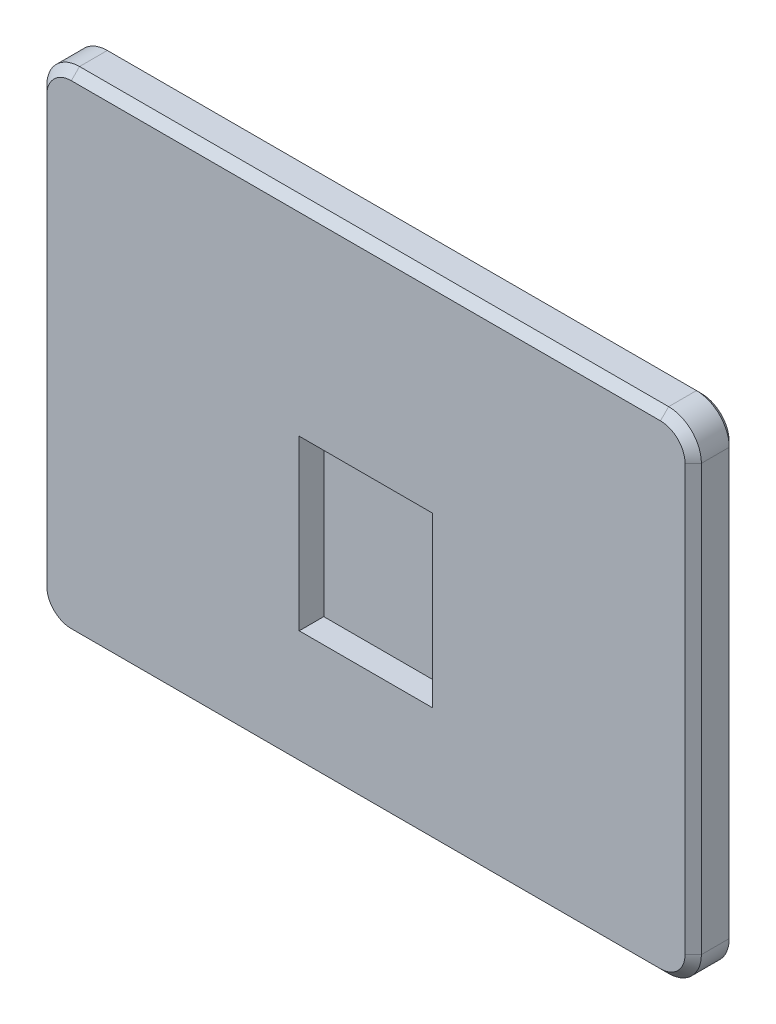
ISO-10303-21;
HEADER;
FILE_DESCRIPTION(('STEP AP214'),'2;1');
FILE_NAME('part.step','',(''),(''),'','','');
FILE_SCHEMA(('AUTOMOTIVE_DESIGN { 1 0 10303 214 1 1 1 1 }'));
ENDSEC;
DATA;
#1=APPLICATION_CONTEXT('core data for automotive mechanical design processes');
#2=APPLICATION_PROTOCOL_DEFINITION('international standard','automotive_design',2000,#1);
#3=PRODUCT_CONTEXT('',#1,'mechanical');
#4=PRODUCT('Part','Part','',(#3));
#5=PRODUCT_RELATED_PRODUCT_CATEGORY('part','',(#4));
#6=PRODUCT_DEFINITION_FORMATION('','',#4);
#7=PRODUCT_DEFINITION_CONTEXT('part definition',#1,'design');
#8=PRODUCT_DEFINITION('design','',#6,#7);
#9=PRODUCT_DEFINITION_SHAPE('','',#8);
#10=(LENGTH_UNIT() NAMED_UNIT(*) SI_UNIT(.MILLI.,.METRE.));
#11=(NAMED_UNIT(*) PLANE_ANGLE_UNIT() SI_UNIT($,.RADIAN.));
#12=(NAMED_UNIT(*) SI_UNIT($,.STERADIAN.) SOLID_ANGLE_UNIT());
#13=UNCERTAINTY_MEASURE_WITH_UNIT(LENGTH_MEASURE(1.E-05),#10,'distance_accuracy_value','');
#14=(GEOMETRIC_REPRESENTATION_CONTEXT(3) GLOBAL_UNCERTAINTY_ASSIGNED_CONTEXT((#13)) GLOBAL_UNIT_ASSIGNED_CONTEXT((#10,
#11,#12)) REPRESENTATION_CONTEXT('',''));
#15=CARTESIAN_POINT('',(0.,0.,0.));
#16=DIRECTION('',(0.,0.,1.));
#17=DIRECTION('',(1.,0.,0.));
#18=AXIS2_PLACEMENT_3D('',#15,#16,#17);
#19=CARTESIAN_POINT('',(20.,-15.,2.5));
#20=DIRECTION('',(-1.,0.,0.));
#21=DIRECTION('',(0.,0.,1.));
#22=AXIS2_PLACEMENT_3D('',#19,#20,#21);
#23=PLANE('',#22);
#24=DIRECTION('',(0.,0.,-1.));
#25=VECTOR('',#24,1.);
#26=CARTESIAN_POINT('',(20.,-13.,2.5));
#27=LINE('',#26,#25);
#28=CARTESIAN_POINT('',(20.,-13.,2.00000000000001));
#29=VERTEX_POINT('',#28);
#30=CARTESIAN_POINT('',(20.,-13.,0.299999999999995));
#31=VERTEX_POINT('',#30);
#32=EDGE_CURVE('E252',#29,#31,#27,.T.);
#33=ORIENTED_EDGE('',*,*,#32,.T.);
#34=DIRECTION('',(0.,1.,0.));
#35=VECTOR('',#34,1.);
#36=CARTESIAN_POINT('',(20.,13.,0.299999999999995));
#37=LINE('',#36,#35);
#38=CARTESIAN_POINT('',(20.,13.,0.299999999999995));
#39=VERTEX_POINT('',#38);
#40=EDGE_CURVE('E375',#31,#39,#37,.T.);
#41=ORIENTED_EDGE('',*,*,#40,.T.);
#42=DIRECTION('',(0.,0.,-1.));
#43=VECTOR('',#42,1.);
#44=CARTESIAN_POINT('',(20.,13.,2.5));
#45=LINE('',#44,#43);
#46=CARTESIAN_POINT('',(20.,13.,2.00000000000001));
#47=VERTEX_POINT('',#46);
#48=EDGE_CURVE('E249',#39,#47,#45,.F.);
#49=ORIENTED_EDGE('',*,*,#48,.T.);
#50=DIRECTION('',(0.,-1.,0.));
#51=VECTOR('',#50,1.);
#52=CARTESIAN_POINT('',(20.,-15.,2.00000000000001));
#53=LINE('',#52,#51);
#54=EDGE_CURVE('E300',#47,#29,#53,.T.);
#55=ORIENTED_EDGE('',*,*,#54,.T.);
#56=EDGE_LOOP('',(#33,#41,#49,#55));
#57=FACE_BOUND('',#56,.T.);
#58=ADVANCED_FACE('F41',(#57),#23,.F.);
#59=CARTESIAN_POINT('',(-20.,15.,2.5));
#60=DIRECTION('',(0.,-1.,0.));
#61=DIRECTION('',(0.,0.,-1.));
#62=AXIS2_PLACEMENT_3D('',#59,#60,#61);
#63=PLANE('',#62);
#64=DIRECTION('',(0.,0.,-1.));
#65=VECTOR('',#64,1.);
#66=CARTESIAN_POINT('',(18.,15.,2.5));
#67=LINE('',#66,#65);
#68=CARTESIAN_POINT('',(18.,15.,2.00000000000001));
#69=VERTEX_POINT('',#68);
#70=CARTESIAN_POINT('',(18.,15.,0.299999999999995));
#71=VERTEX_POINT('',#70);
#72=EDGE_CURVE('E256',#69,#71,#67,.T.);
#73=ORIENTED_EDGE('',*,*,#72,.T.);
#74=DIRECTION('',(-1.,0.,0.));
#75=VECTOR('',#74,1.);
#76=CARTESIAN_POINT('',(-18.,15.,0.299999999999995));
#77=LINE('',#76,#75);
#78=CARTESIAN_POINT('',(-18.,15.,0.299999999999995));
#79=VERTEX_POINT('',#78);
#80=EDGE_CURVE('E381',#71,#79,#77,.T.);
#81=ORIENTED_EDGE('',*,*,#80,.T.);
#82=DIRECTION('',(0.,0.,-1.));
#83=VECTOR('',#82,1.);
#84=CARTESIAN_POINT('',(-18.,15.,2.5));
#85=LINE('',#84,#83);
#86=CARTESIAN_POINT('',(-18.,15.,2.00000000000001));
#87=VERTEX_POINT('',#86);
#88=EDGE_CURVE('E260',#79,#87,#85,.F.);
#89=ORIENTED_EDGE('',*,*,#88,.T.);
#90=DIRECTION('',(1.,0.,0.));
#91=VECTOR('',#90,1.);
#92=CARTESIAN_POINT('',(-20.,15.,2.00000000000001));
#93=LINE('',#92,#91);
#94=EDGE_CURVE('E314',#87,#69,#93,.T.);
#95=ORIENTED_EDGE('',*,*,#94,.T.);
#96=EDGE_LOOP('',(#73,#81,#89,#95));
#97=FACE_BOUND('',#96,.T.);
#98=ADVANCED_FACE('F462',(#97),#63,.F.);
#99=CARTESIAN_POINT('',(-20.,-15.,2.5));
#100=DIRECTION('',(1.,0.,0.));
#101=DIRECTION('',(0.,0.,-1.));
#102=AXIS2_PLACEMENT_3D('',#99,#100,#101);
#103=PLANE('',#102);
#104=DIRECTION('',(0.,0.,-1.));
#105=VECTOR('',#104,1.);
#106=CARTESIAN_POINT('',(-20.,13.,2.5));
#107=LINE('',#106,#105);
#108=CARTESIAN_POINT('',(-20.,13.,2.00000000000001));
#109=VERTEX_POINT('',#108);
#110=CARTESIAN_POINT('',(-20.,13.,0.299999999999995));
#111=VERTEX_POINT('',#110);
#112=EDGE_CURVE('E243',#109,#111,#107,.T.);
#113=ORIENTED_EDGE('',*,*,#112,.T.);
#114=DIRECTION('',(0.,-1.,0.));
#115=VECTOR('',#114,1.);
#116=CARTESIAN_POINT('',(-20.,-13.,0.299999999999995));
#117=LINE('',#116,#115);
#118=CARTESIAN_POINT('',(-20.,-13.,0.299999999999995));
#119=VERTEX_POINT('',#118);
#120=EDGE_CURVE('E67',#111,#119,#117,.T.);
#121=ORIENTED_EDGE('',*,*,#120,.T.);
#122=DIRECTION('',(0.,0.,-1.));
#123=VECTOR('',#122,1.);
#124=CARTESIAN_POINT('',(-20.,-13.,2.5));
#125=LINE('',#124,#123);
#126=CARTESIAN_POINT('',(-20.,-13.,2.00000000000001));
#127=VERTEX_POINT('',#126);
#128=EDGE_CURVE('E246',#119,#127,#125,.F.);
#129=ORIENTED_EDGE('',*,*,#128,.T.);
#130=DIRECTION('',(0.,1.,0.));
#131=VECTOR('',#130,1.);
#132=CARTESIAN_POINT('',(-20.,-15.,2.00000000000001));
#133=LINE('',#132,#131);
#134=EDGE_CURVE('E303',#127,#109,#133,.T.);
#135=ORIENTED_EDGE('',*,*,#134,.T.);
#136=EDGE_LOOP('',(#113,#121,#129,#135));
#137=FACE_BOUND('',#136,.T.);
#138=ADVANCED_FACE('F434',(#137),#103,.F.);
#139=CARTESIAN_POINT('',(-20.,-15.,2.5));
#140=DIRECTION('',(0.,1.,0.));
#141=DIRECTION('',(0.,0.,1.));
#142=AXIS2_PLACEMENT_3D('',#139,#140,#141);
#143=PLANE('',#142);
#144=DIRECTION('',(0.,0.,-1.));
#145=VECTOR('',#144,1.);
#146=CARTESIAN_POINT('',(-18.,-15.,2.5));
#147=LINE('',#146,#145);
#148=CARTESIAN_POINT('',(-18.,-15.,2.00000000000001));
#149=VERTEX_POINT('',#148);
#150=CARTESIAN_POINT('',(-18.,-15.,0.299999999999995));
#151=VERTEX_POINT('',#150);
#152=EDGE_CURVE('E240',#149,#151,#147,.T.);
#153=ORIENTED_EDGE('',*,*,#152,.T.);
#154=DIRECTION('',(1.,0.,0.));
#155=VECTOR('',#154,1.);
#156=CARTESIAN_POINT('',(18.,-15.,0.299999999999995));
#157=LINE('',#156,#155);
#158=CARTESIAN_POINT('',(18.,-15.,0.299999999999995));
#159=VERTEX_POINT('',#158);
#160=EDGE_CURVE('E11',#151,#159,#157,.T.);
#161=ORIENTED_EDGE('',*,*,#160,.T.);
#162=DIRECTION('',(0.,0.,-1.));
#163=VECTOR('',#162,1.);
#164=CARTESIAN_POINT('',(18.,-15.,2.5));
#165=LINE('',#164,#163);
#166=CARTESIAN_POINT('',(18.,-15.,2.00000000000001));
#167=VERTEX_POINT('',#166);
#168=EDGE_CURVE('E232',#159,#167,#165,.F.);
#169=ORIENTED_EDGE('',*,*,#168,.T.);
#170=DIRECTION('',(-1.,0.,0.));
#171=VECTOR('',#170,1.);
#172=CARTESIAN_POINT('',(-20.,-15.,2.00000000000001));
#173=LINE('',#172,#171);
#174=EDGE_CURVE('E288',#167,#149,#173,.T.);
#175=ORIENTED_EDGE('',*,*,#174,.T.);
#176=EDGE_LOOP('',(#153,#161,#169,#175));
#177=FACE_BOUND('',#176,.T.);
#178=ADVANCED_FACE('F493',(#177),#143,.F.);
#179=CARTESIAN_POINT('',(0.,0.,2.5));
#180=DIRECTION('',(0.,0.,-1.));
#181=DIRECTION('',(-1.,0.,0.));
#182=AXIS2_PLACEMENT_3D('',#179,#180,#181);
#183=PLANE('',#182);
#184=CARTESIAN_POINT('',(-18.,-13.,2.5));
#185=DIRECTION('',(0.,0.,-1.));
#186=DIRECTION('',(-1.,0.,0.));
#187=AXIS2_PLACEMENT_3D('',#184,#185,#186);
#188=CIRCLE('',#187,1.50000000000001);
#189=CARTESIAN_POINT('',(-19.5,-13.,2.5));
#190=VERTEX_POINT('',#189);
#191=CARTESIAN_POINT('',(-18.,-14.5,2.5));
#192=VERTEX_POINT('',#191);
#193=EDGE_CURVE('E278',#190,#192,#188,.F.);
#194=ORIENTED_EDGE('',*,*,#193,.T.);
#195=DIRECTION('',(1.,0.,0.));
#196=VECTOR('',#195,1.);
#197=CARTESIAN_POINT('',(0.,-14.5,2.5));
#198=LINE('',#197,#196);
#199=CARTESIAN_POINT('',(18.,-14.5,2.5));
#200=VERTEX_POINT('',#199);
#201=EDGE_CURVE('E284',#192,#200,#198,.T.);
#202=ORIENTED_EDGE('',*,*,#201,.T.);
#203=CARTESIAN_POINT('',(18.,-13.,2.5));
#204=DIRECTION('',(0.,0.,-1.));
#205=DIRECTION('',(-1.,0.,0.));
#206=AXIS2_PLACEMENT_3D('',#203,#204,#205);
#207=CIRCLE('',#206,1.50000000000001);
#208=CARTESIAN_POINT('',(19.5,-13.,2.5));
#209=VERTEX_POINT('',#208);
#210=EDGE_CURVE('E281',#200,#209,#207,.F.);
#211=ORIENTED_EDGE('',*,*,#210,.T.);
#212=DIRECTION('',(0.,1.,0.));
#213=VECTOR('',#212,1.);
#214=CARTESIAN_POINT('',(19.5,0.,2.5));
#215=LINE('',#214,#213);
#216=CARTESIAN_POINT('',(19.5,13.,2.5));
#217=VERTEX_POINT('',#216);
#218=EDGE_CURVE('E275',#209,#217,#215,.T.);
#219=ORIENTED_EDGE('',*,*,#218,.T.);
#220=CARTESIAN_POINT('',(18.,13.,2.5));
#221=DIRECTION('',(0.,0.,-1.));
#222=DIRECTION('',(-1.,0.,0.));
#223=AXIS2_PLACEMENT_3D('',#220,#221,#222);
#224=CIRCLE('',#223,1.50000000000001);
#225=CARTESIAN_POINT('',(18.,14.5,2.5));
#226=VERTEX_POINT('',#225);
#227=EDGE_CURVE('E269',#217,#226,#224,.F.);
#228=ORIENTED_EDGE('',*,*,#227,.T.);
#229=DIRECTION('',(-1.,0.,0.));
#230=VECTOR('',#229,1.);
#231=CARTESIAN_POINT('',(0.,14.5,2.5));
#232=LINE('',#231,#230);
#233=CARTESIAN_POINT('',(-18.,14.5,2.5));
#234=VERTEX_POINT('',#233);
#235=EDGE_CURVE('E263',#226,#234,#232,.T.);
#236=ORIENTED_EDGE('',*,*,#235,.T.);
#237=CARTESIAN_POINT('',(-18.,13.,2.5));
#238=DIRECTION('',(0.,0.,-1.));
#239=DIRECTION('',(-1.,0.,0.));
#240=AXIS2_PLACEMENT_3D('',#237,#238,#239);
#241=CIRCLE('',#240,1.50000000000001);
#242=CARTESIAN_POINT('',(-19.5,13.,2.5));
#243=VERTEX_POINT('',#242);
#244=EDGE_CURVE('E266',#234,#243,#241,.F.);
#245=ORIENTED_EDGE('',*,*,#244,.T.);
#246=DIRECTION('',(0.,-1.,0.));
#247=VECTOR('',#246,1.);
#248=CARTESIAN_POINT('',(-19.5,0.,2.5));
#249=LINE('',#248,#247);
#250=EDGE_CURVE('E272',#243,#190,#249,.T.);
#251=ORIENTED_EDGE('',*,*,#250,.T.);
#252=EDGE_LOOP('',(#194,#202,#211,#219,#228,#236,#245,#251));
#253=FACE_BOUND('',#252,.T.);
#254=DIRECTION('',(-1.,0.,0.));
#255=VECTOR('',#254,1.);
#256=CARTESIAN_POINT('',(-4.075,2.65,2.5));
#257=LINE('',#256,#255);
#258=CARTESIAN_POINT('',(4.075,2.65,2.5));
#259=VERTEX_POINT('',#258);
#260=CARTESIAN_POINT('',(-4.075,2.65,2.5));
#261=VERTEX_POINT('',#260);
#262=EDGE_CURVE('E222',#259,#261,#257,.T.);
#263=ORIENTED_EDGE('',*,*,#262,.F.);
#264=DIRECTION('',(0.,1.,0.));
#265=VECTOR('',#264,1.);
#266=CARTESIAN_POINT('',(4.075,-7.65,2.5));
#267=LINE('',#266,#265);
#268=CARTESIAN_POINT('',(4.075,-7.65,2.5));
#269=VERTEX_POINT('',#268);
#270=EDGE_CURVE('E189',#269,#259,#267,.T.);
#271=ORIENTED_EDGE('',*,*,#270,.F.);
#272=DIRECTION('',(1.,0.,0.));
#273=VECTOR('',#272,1.);
#274=CARTESIAN_POINT('',(-4.075,-7.65,2.5));
#275=LINE('',#274,#273);
#276=CARTESIAN_POINT('',(-4.075,-7.65,2.5));
#277=VERTEX_POINT('',#276);
#278=EDGE_CURVE('E209',#277,#269,#275,.T.);
#279=ORIENTED_EDGE('',*,*,#278,.F.);
#280=DIRECTION('',(0.,-1.,0.));
#281=VECTOR('',#280,1.);
#282=CARTESIAN_POINT('',(-4.075,-7.65,2.5));
#283=LINE('',#282,#281);
#284=EDGE_CURVE('E213',#261,#277,#283,.T.);
#285=ORIENTED_EDGE('',*,*,#284,.F.);
#286=EDGE_LOOP('',(#263,#271,#279,#285));
#287=FACE_BOUND('',#286,.T.);
#288=ADVANCED_FACE('F448',(#253,#287),#183,.F.);
#289=CARTESIAN_POINT('',(0.,0.,0.));
#290=DIRECTION('',(0.,0.,-1.));
#291=DIRECTION('',(-1.,0.,0.));
#292=AXIS2_PLACEMENT_3D('',#289,#290,#291);
#293=PLANE('',#292);
#294=DIRECTION('',(0.,-1.,0.));
#295=VECTOR('',#294,1.);
#296=CARTESIAN_POINT('',(19.7,-13.,0.));
#297=LINE('',#296,#295);
#298=CARTESIAN_POINT('',(19.7,13.,0.));
#299=VERTEX_POINT('',#298);
#300=CARTESIAN_POINT('',(19.7,-13.,0.));
#301=VERTEX_POINT('',#300);
#302=EDGE_CURVE('E364',#299,#301,#297,.T.);
#303=ORIENTED_EDGE('',*,*,#302,.T.);
#304=CARTESIAN_POINT('',(18.,-13.,0.));
#305=DIRECTION('',(0.,0.,-1.));
#306=DIRECTION('',(-1.,0.,0.));
#307=AXIS2_PLACEMENT_3D('',#304,#305,#306);
#308=CIRCLE('',#307,1.70000000000001);
#309=CARTESIAN_POINT('',(18.,-14.7,0.));
#310=VERTEX_POINT('',#309);
#311=EDGE_CURVE('E367',#301,#310,#308,.T.);
#312=ORIENTED_EDGE('',*,*,#311,.T.);
#313=DIRECTION('',(-1.,0.,0.));
#314=VECTOR('',#313,1.);
#315=CARTESIAN_POINT('',(-18.,-14.7,0.));
#316=LINE('',#315,#314);
#317=CARTESIAN_POINT('',(-18.,-14.7,0.));
#318=VERTEX_POINT('',#317);
#319=EDGE_CURVE('E317',#310,#318,#316,.T.);
#320=ORIENTED_EDGE('',*,*,#319,.T.);
#321=CARTESIAN_POINT('',(-18.,-13.,0.));
#322=DIRECTION('',(0.,0.,-1.));
#323=DIRECTION('',(-1.,0.,0.));
#324=AXIS2_PLACEMENT_3D('',#321,#322,#323);
#325=CIRCLE('',#324,1.7);
#326=CARTESIAN_POINT('',(-19.7,-13.,0.));
#327=VERTEX_POINT('',#326);
#328=EDGE_CURVE('E349',#318,#327,#325,.T.);
#329=ORIENTED_EDGE('',*,*,#328,.T.);
#330=DIRECTION('',(0.,1.,0.));
#331=VECTOR('',#330,1.);
#332=CARTESIAN_POINT('',(-19.7,13.,0.));
#333=LINE('',#332,#331);
#334=CARTESIAN_POINT('',(-19.7,13.,0.));
#335=VERTEX_POINT('',#334);
#336=EDGE_CURVE('E352',#327,#335,#333,.T.);
#337=ORIENTED_EDGE('',*,*,#336,.T.);
#338=CARTESIAN_POINT('',(-18.,13.,0.));
#339=DIRECTION('',(0.,0.,-1.));
#340=DIRECTION('',(-1.,0.,0.));
#341=AXIS2_PLACEMENT_3D('',#338,#339,#340);
#342=CIRCLE('',#341,1.70000000000001);
#343=CARTESIAN_POINT('',(-18.,14.7,0.));
#344=VERTEX_POINT('',#343);
#345=EDGE_CURVE('E355',#335,#344,#342,.T.);
#346=ORIENTED_EDGE('',*,*,#345,.T.);
#347=DIRECTION('',(1.,0.,0.));
#348=VECTOR('',#347,1.);
#349=CARTESIAN_POINT('',(18.,14.7,0.));
#350=LINE('',#349,#348);
#351=CARTESIAN_POINT('',(18.,14.7,0.));
#352=VERTEX_POINT('',#351);
#353=EDGE_CURVE('E358',#344,#352,#350,.T.);
#354=ORIENTED_EDGE('',*,*,#353,.T.);
#355=CARTESIAN_POINT('',(18.,13.,0.));
#356=DIRECTION('',(0.,0.,-1.));
#357=DIRECTION('',(-1.,0.,0.));
#358=AXIS2_PLACEMENT_3D('',#355,#356,#357);
#359=CIRCLE('',#358,1.7);
#360=EDGE_CURVE('E361',#352,#299,#359,.T.);
#361=ORIENTED_EDGE('',*,*,#360,.T.);
#362=EDGE_LOOP('',(#303,#312,#320,#329,#337,#346,#354,#361));
#363=FACE_BOUND('',#362,.T.);
#364=ADVANCED_FACE('F479',(#363),#293,.T.);
#365=CARTESIAN_POINT('',(4.075,-7.65,1.));
#366=DIRECTION('',(1.,0.,0.));
#367=DIRECTION('',(0.,0.,-1.));
#368=AXIS2_PLACEMENT_3D('',#365,#366,#367);
#369=PLANE('',#368);
#370=ORIENTED_EDGE('',*,*,#270,.T.);
#371=DIRECTION('',(0.,0.,1.));
#372=VECTOR('',#371,1.);
#373=CARTESIAN_POINT('',(4.075,2.65,1.));
#374=LINE('',#373,#372);
#375=CARTESIAN_POINT('',(4.075,2.65,1.));
#376=VERTEX_POINT('',#375);
#377=EDGE_CURVE('E182',#376,#259,#374,.T.);
#378=ORIENTED_EDGE('',*,*,#377,.F.);
#379=DIRECTION('',(0.,1.,0.));
#380=VECTOR('',#379,1.);
#381=CARTESIAN_POINT('',(4.075,-7.65,1.));
#382=LINE('',#381,#380);
#383=CARTESIAN_POINT('',(4.075,-7.65,1.));
#384=VERTEX_POINT('',#383);
#385=EDGE_CURVE('E186',#384,#376,#382,.T.);
#386=ORIENTED_EDGE('',*,*,#385,.F.);
#387=DIRECTION('',(0.,0.,1.));
#388=VECTOR('',#387,1.);
#389=CARTESIAN_POINT('',(4.075,-7.65,1.));
#390=LINE('',#389,#388);
#391=EDGE_CURVE('E229',#384,#269,#390,.T.);
#392=ORIENTED_EDGE('',*,*,#391,.T.);
#393=EDGE_LOOP('',(#370,#378,#386,#392));
#394=FACE_BOUND('',#393,.T.);
#395=ADVANCED_FACE('F184',(#394),#369,.F.);
#396=CARTESIAN_POINT('',(-4.075,-7.65,1.));
#397=DIRECTION('',(0.,-1.,0.));
#398=DIRECTION('',(0.,0.,-1.));
#399=AXIS2_PLACEMENT_3D('',#396,#397,#398);
#400=PLANE('',#399);
#401=ORIENTED_EDGE('',*,*,#278,.T.);
#402=ORIENTED_EDGE('',*,*,#391,.F.);
#403=DIRECTION('',(1.,0.,0.));
#404=VECTOR('',#403,1.);
#405=CARTESIAN_POINT('',(-4.075,-7.65,1.));
#406=LINE('',#405,#404);
#407=CARTESIAN_POINT('',(-4.075,-7.65,1.));
#408=VERTEX_POINT('',#407);
#409=EDGE_CURVE('E195',#408,#384,#406,.T.);
#410=ORIENTED_EDGE('',*,*,#409,.F.);
#411=DIRECTION('',(0.,0.,1.));
#412=VECTOR('',#411,1.);
#413=CARTESIAN_POINT('',(-4.075,-7.65,1.));
#414=LINE('',#413,#412);
#415=EDGE_CURVE('E233',#408,#277,#414,.T.);
#416=ORIENTED_EDGE('',*,*,#415,.T.);
#417=EDGE_LOOP('',(#401,#402,#410,#416));
#418=FACE_BOUND('',#417,.T.);
#419=ADVANCED_FACE('F722',(#418),#400,.F.);
#420=CARTESIAN_POINT('',(-4.075,-7.65,1.));
#421=DIRECTION('',(-1.,0.,0.));
#422=DIRECTION('',(0.,0.,1.));
#423=AXIS2_PLACEMENT_3D('',#420,#421,#422);
#424=PLANE('',#423);
#425=ORIENTED_EDGE('',*,*,#284,.T.);
#426=ORIENTED_EDGE('',*,*,#415,.F.);
#427=DIRECTION('',(0.,-1.,0.));
#428=VECTOR('',#427,1.);
#429=CARTESIAN_POINT('',(-4.075,-7.65,1.));
#430=LINE('',#429,#428);
#431=CARTESIAN_POINT('',(-4.075,2.65,1.));
#432=VERTEX_POINT('',#431);
#433=EDGE_CURVE('E204',#432,#408,#430,.T.);
#434=ORIENTED_EDGE('',*,*,#433,.F.);
#435=DIRECTION('',(0.,0.,1.));
#436=VECTOR('',#435,1.);
#437=CARTESIAN_POINT('',(-4.075,2.65,1.));
#438=LINE('',#437,#436);
#439=EDGE_CURVE('E194',#432,#261,#438,.T.);
#440=ORIENTED_EDGE('',*,*,#439,.T.);
#441=EDGE_LOOP('',(#425,#426,#434,#440));
#442=FACE_BOUND('',#441,.T.);
#443=ADVANCED_FACE('F714',(#442),#424,.F.);
#444=CARTESIAN_POINT('',(-4.075,2.65,1.));
#445=DIRECTION('',(0.,1.,0.));
#446=DIRECTION('',(0.,0.,1.));
#447=AXIS2_PLACEMENT_3D('',#444,#445,#446);
#448=PLANE('',#447);
#449=ORIENTED_EDGE('',*,*,#262,.T.);
#450=ORIENTED_EDGE('',*,*,#439,.F.);
#451=DIRECTION('',(-1.,0.,0.));
#452=VECTOR('',#451,1.);
#453=CARTESIAN_POINT('',(-4.075,2.65,1.));
#454=LINE('',#453,#452);
#455=EDGE_CURVE('E198',#376,#432,#454,.T.);
#456=ORIENTED_EDGE('',*,*,#455,.F.);
#457=ORIENTED_EDGE('',*,*,#377,.T.);
#458=EDGE_LOOP('',(#449,#450,#456,#457));
#459=FACE_BOUND('',#458,.T.);
#460=ADVANCED_FACE('F199',(#459),#448,.F.);
#461=CARTESIAN_POINT('',(0.,0.,1.));
#462=DIRECTION('',(0.,0.,-1.));
#463=DIRECTION('',(-1.,0.,0.));
#464=AXIS2_PLACEMENT_3D('',#461,#462,#463);
#465=PLANE('',#464);
#466=ORIENTED_EDGE('',*,*,#385,.T.);
#467=ORIENTED_EDGE('',*,*,#455,.T.);
#468=ORIENTED_EDGE('',*,*,#433,.T.);
#469=ORIENTED_EDGE('',*,*,#409,.T.);
#470=EDGE_LOOP('',(#466,#467,#468,#469));
#471=FACE_BOUND('',#470,.T.);
#472=ADVANCED_FACE('F206',(#471),#465,.F.);
#473=CARTESIAN_POINT('',(-18.,-13.,2.5));
#474=DIRECTION('',(0.,0.,-1.));
#475=DIRECTION('',(-1.,0.,0.));
#476=AXIS2_PLACEMENT_3D('',#473,#474,#475);
#477=CYLINDRICAL_SURFACE('',#476,2.);
#478=ORIENTED_EDGE('',*,*,#128,.F.);
#479=CARTESIAN_POINT('',(-18.,-13.,0.299999999999995));
#480=DIRECTION('',(0.,0.,-1.));
#481=DIRECTION('',(-1.,0.,0.));
#482=AXIS2_PLACEMENT_3D('',#479,#480,#481);
#483=CIRCLE('',#482,2.);
#484=EDGE_CURVE('E52',#119,#151,#483,.F.);
#485=ORIENTED_EDGE('',*,*,#484,.T.);
#486=ORIENTED_EDGE('',*,*,#152,.F.);
#487=CARTESIAN_POINT('',(-18.,-13.,2.00000000000001));
#488=DIRECTION('',(0.,0.,-1.));
#489=DIRECTION('',(-1.,0.,0.));
#490=AXIS2_PLACEMENT_3D('',#487,#488,#489);
#491=CIRCLE('',#490,2.);
#492=EDGE_CURVE('E296',#149,#127,#491,.T.);
#493=ORIENTED_EDGE('',*,*,#492,.T.);
#494=EDGE_LOOP('',(#478,#485,#486,#493));
#495=FACE_BOUND('',#494,.T.);
#496=ADVANCED_FACE('F519',(#495),#477,.T.);
#497=CARTESIAN_POINT('',(18.,-13.,2.5));
#498=DIRECTION('',(0.,0.,-1.));
#499=DIRECTION('',(-1.,0.,0.));
#500=AXIS2_PLACEMENT_3D('',#497,#498,#499);
#501=CYLINDRICAL_SURFACE('',#500,2.);
#502=ORIENTED_EDGE('',*,*,#168,.F.);
#503=CARTESIAN_POINT('',(18.,-13.,0.299999999999995));
#504=DIRECTION('',(0.,0.,-1.));
#505=DIRECTION('',(-1.,0.,0.));
#506=AXIS2_PLACEMENT_3D('',#503,#504,#505);
#507=CIRCLE('',#506,2.);
#508=EDGE_CURVE('E371',#159,#31,#507,.F.);
#509=ORIENTED_EDGE('',*,*,#508,.T.);
#510=ORIENTED_EDGE('',*,*,#32,.F.);
#511=CARTESIAN_POINT('',(18.,-13.,2.00000000000001));
#512=DIRECTION('',(0.,0.,-1.));
#513=DIRECTION('',(-1.,0.,0.));
#514=AXIS2_PLACEMENT_3D('',#511,#512,#513);
#515=CIRCLE('',#514,2.);
#516=EDGE_CURVE('E292',#29,#167,#515,.T.);
#517=ORIENTED_EDGE('',*,*,#516,.T.);
#518=EDGE_LOOP('',(#502,#509,#510,#517));
#519=FACE_BOUND('',#518,.T.);
#520=ADVANCED_FACE('F496',(#519),#501,.T.);
#521=CARTESIAN_POINT('',(-18.,13.,2.5));
#522=DIRECTION('',(0.,0.,-1.));
#523=DIRECTION('',(-1.,0.,0.));
#524=AXIS2_PLACEMENT_3D('',#521,#522,#523);
#525=CYLINDRICAL_SURFACE('',#524,2.);
#526=ORIENTED_EDGE('',*,*,#88,.F.);
#527=CARTESIAN_POINT('',(-18.,13.,0.299999999999995));
#528=DIRECTION('',(0.,0.,-1.));
#529=DIRECTION('',(-1.,0.,0.));
#530=AXIS2_PLACEMENT_3D('',#527,#528,#529);
#531=CIRCLE('',#530,2.);
#532=EDGE_CURVE('E384',#79,#111,#531,.F.);
#533=ORIENTED_EDGE('',*,*,#532,.T.);
#534=ORIENTED_EDGE('',*,*,#112,.F.);
#535=CARTESIAN_POINT('',(-18.,13.,2.00000000000001));
#536=DIRECTION('',(0.,0.,-1.));
#537=DIRECTION('',(-1.,0.,0.));
#538=AXIS2_PLACEMENT_3D('',#535,#536,#537);
#539=CIRCLE('',#538,2.);
#540=EDGE_CURVE('E310',#109,#87,#539,.T.);
#541=ORIENTED_EDGE('',*,*,#540,.T.);
#542=EDGE_LOOP('',(#526,#533,#534,#541));
#543=FACE_BOUND('',#542,.T.);
#544=ADVANCED_FACE('F432',(#543),#525,.T.);
#545=CARTESIAN_POINT('',(18.,13.,2.5));
#546=DIRECTION('',(0.,0.,-1.));
#547=DIRECTION('',(-1.,0.,0.));
#548=AXIS2_PLACEMENT_3D('',#545,#546,#547);
#549=CYLINDRICAL_SURFACE('',#548,2.);
#550=ORIENTED_EDGE('',*,*,#48,.F.);
#551=CARTESIAN_POINT('',(18.,13.,0.299999999999995));
#552=DIRECTION('',(0.,0.,-1.));
#553=DIRECTION('',(-1.,0.,0.));
#554=AXIS2_PLACEMENT_3D('',#551,#552,#553);
#555=CIRCLE('',#554,2.);
#556=EDGE_CURVE('E378',#39,#71,#555,.F.);
#557=ORIENTED_EDGE('',*,*,#556,.T.);
#558=ORIENTED_EDGE('',*,*,#72,.F.);
#559=CARTESIAN_POINT('',(18.,13.,2.00000000000001));
#560=DIRECTION('',(0.,0.,-1.));
#561=DIRECTION('',(-1.,0.,0.));
#562=AXIS2_PLACEMENT_3D('',#559,#560,#561);
#563=CIRCLE('',#562,2.);
#564=EDGE_CURVE('E306',#69,#47,#563,.T.);
#565=ORIENTED_EDGE('',*,*,#564,.T.);
#566=EDGE_LOOP('',(#550,#557,#558,#565));
#567=FACE_BOUND('',#566,.T.);
#568=ADVANCED_FACE('F465',(#567),#549,.T.);
#569=CARTESIAN_POINT('',(0.,14.5,2.5));
#570=DIRECTION('',(0.,-0.707106781186547,-0.707106781186547));
#571=DIRECTION('',(-1.,0.,0.));
#572=AXIS2_PLACEMENT_3D('',#569,#570,#571);
#573=PLANE('',#572);
#574=DIRECTION('',(0.,-0.707106781186547,0.707106781186547));
#575=VECTOR('',#574,1.);
#576=CARTESIAN_POINT('',(18.,15.,2.00000000000001));
#577=LINE('',#576,#575);
#578=EDGE_CURVE('E340',#69,#226,#577,.T.);
#579=ORIENTED_EDGE('',*,*,#578,.F.);
#580=ORIENTED_EDGE('',*,*,#94,.F.);
#581=DIRECTION('',(0.,0.707106781186547,-0.707106781186547));
#582=VECTOR('',#581,1.);
#583=CARTESIAN_POINT('',(-18.,14.5,2.5));
#584=LINE('',#583,#582);
#585=EDGE_CURVE('E223',#234,#87,#584,.T.);
#586=ORIENTED_EDGE('',*,*,#585,.F.);
#587=ORIENTED_EDGE('',*,*,#235,.F.);
#588=EDGE_LOOP('',(#579,#580,#586,#587));
#589=FACE_BOUND('',#588,.T.);
#590=ADVANCED_FACE('F458',(#589),#573,.F.);
#591=CARTESIAN_POINT('',(-18.,13.,2.5));
#592=DIRECTION('',(0.,0.,-1.));
#593=DIRECTION('',(-1.,0.,0.));
#594=AXIS2_PLACEMENT_3D('',#591,#592,#593);
#595=CONICAL_SURFACE('',#594,1.50000000000001,0.785398163397447);
#596=ORIENTED_EDGE('',*,*,#585,.T.);
#597=ORIENTED_EDGE('',*,*,#540,.F.);
#598=DIRECTION('',(-0.707106781186547,0.,-0.707106781186547));
#599=VECTOR('',#598,1.);
#600=CARTESIAN_POINT('',(-19.5,13.,2.5));
#601=LINE('',#600,#599);
#602=EDGE_CURVE('E336',#243,#109,#601,.T.);
#603=ORIENTED_EDGE('',*,*,#602,.F.);
#604=ORIENTED_EDGE('',*,*,#244,.F.);
#605=EDGE_LOOP('',(#596,#597,#603,#604));
#606=FACE_BOUND('',#605,.T.);
#607=ADVANCED_FACE('F454',(#606),#595,.T.);
#608=CARTESIAN_POINT('',(18.,13.,2.5));
#609=DIRECTION('',(0.,0.,-1.));
#610=DIRECTION('',(-1.,0.,0.));
#611=AXIS2_PLACEMENT_3D('',#608,#609,#610);
#612=CONICAL_SURFACE('',#611,1.50000000000001,0.785398163397448);
#613=ORIENTED_EDGE('',*,*,#578,.T.);
#614=ORIENTED_EDGE('',*,*,#227,.F.);
#615=DIRECTION('',(-0.707106781186547,0.,0.707106781186547));
#616=VECTOR('',#615,1.);
#617=CARTESIAN_POINT('',(20.,13.,2.00000000000001));
#618=LINE('',#617,#616);
#619=EDGE_CURVE('E332',#47,#217,#618,.T.);
#620=ORIENTED_EDGE('',*,*,#619,.F.);
#621=ORIENTED_EDGE('',*,*,#564,.F.);
#622=EDGE_LOOP('',(#613,#614,#620,#621));
#623=FACE_BOUND('',#622,.T.);
#624=ADVANCED_FACE('F560',(#623),#612,.T.);
#625=CARTESIAN_POINT('',(-19.5,0.,2.5));
#626=DIRECTION('',(0.707106781186547,0.,-0.707106781186547));
#627=DIRECTION('',(0.,-1.,0.));
#628=AXIS2_PLACEMENT_3D('',#625,#626,#627);
#629=PLANE('',#628);
#630=ORIENTED_EDGE('',*,*,#602,.T.);
#631=ORIENTED_EDGE('',*,*,#134,.F.);
#632=DIRECTION('',(-0.707106781186547,0.,-0.707106781186547));
#633=VECTOR('',#632,1.);
#634=CARTESIAN_POINT('',(-19.5,-13.,2.5));
#635=LINE('',#634,#633);
#636=EDGE_CURVE('E328',#190,#127,#635,.T.);
#637=ORIENTED_EDGE('',*,*,#636,.F.);
#638=ORIENTED_EDGE('',*,*,#250,.F.);
#639=EDGE_LOOP('',(#630,#631,#637,#638));
#640=FACE_BOUND('',#639,.T.);
#641=ADVANCED_FACE('F438',(#640),#629,.F.);
#642=CARTESIAN_POINT('',(19.5,0.,2.5));
#643=DIRECTION('',(-0.707106781186547,0.,-0.707106781186547));
#644=DIRECTION('',(0.,1.,0.));
#645=AXIS2_PLACEMENT_3D('',#642,#643,#644);
#646=PLANE('',#645);
#647=ORIENTED_EDGE('',*,*,#619,.T.);
#648=ORIENTED_EDGE('',*,*,#218,.F.);
#649=DIRECTION('',(-0.707106781186547,0.,0.707106781186547));
#650=VECTOR('',#649,1.);
#651=CARTESIAN_POINT('',(20.,-13.,2.00000000000001));
#652=LINE('',#651,#650);
#653=EDGE_CURVE('E324',#29,#209,#652,.T.);
#654=ORIENTED_EDGE('',*,*,#653,.F.);
#655=ORIENTED_EDGE('',*,*,#54,.F.);
#656=EDGE_LOOP('',(#647,#648,#654,#655));
#657=FACE_BOUND('',#656,.T.);
#658=ADVANCED_FACE('F548',(#657),#646,.F.);
#659=CARTESIAN_POINT('',(-18.,-13.,2.5));
#660=DIRECTION('',(0.,0.,-1.));
#661=DIRECTION('',(-1.,0.,0.));
#662=AXIS2_PLACEMENT_3D('',#659,#660,#661);
#663=CONICAL_SURFACE('',#662,1.50000000000001,0.785398163397448);
#664=ORIENTED_EDGE('',*,*,#636,.T.);
#665=ORIENTED_EDGE('',*,*,#492,.F.);
#666=DIRECTION('',(0.,-0.707106781186547,-0.707106781186547));
#667=VECTOR('',#666,1.);
#668=CARTESIAN_POINT('',(-18.,-14.5,2.5));
#669=LINE('',#668,#667);
#670=EDGE_CURVE('E321',#192,#149,#669,.T.);
#671=ORIENTED_EDGE('',*,*,#670,.F.);
#672=ORIENTED_EDGE('',*,*,#193,.F.);
#673=EDGE_LOOP('',(#664,#665,#671,#672));
#674=FACE_BOUND('',#673,.T.);
#675=ADVANCED_FACE('F444',(#674),#663,.T.);
#676=CARTESIAN_POINT('',(18.,-13.,2.5));
#677=DIRECTION('',(0.,0.,-1.));
#678=DIRECTION('',(-1.,0.,0.));
#679=AXIS2_PLACEMENT_3D('',#676,#677,#678);
#680=CONICAL_SURFACE('',#679,1.50000000000001,0.785398163397447);
#681=ORIENTED_EDGE('',*,*,#653,.T.);
#682=ORIENTED_EDGE('',*,*,#210,.F.);
#683=DIRECTION('',(0.,0.707106781186546,0.707106781186549));
#684=VECTOR('',#683,1.);
#685=CARTESIAN_POINT('',(18.,-15.,2.00000000000001));
#686=LINE('',#685,#684);
#687=EDGE_CURVE('E318',#167,#200,#686,.T.);
#688=ORIENTED_EDGE('',*,*,#687,.F.);
#689=ORIENTED_EDGE('',*,*,#516,.F.);
#690=EDGE_LOOP('',(#681,#682,#688,#689));
#691=FACE_BOUND('',#690,.T.);
#692=ADVANCED_FACE('F535',(#691),#680,.T.);
#693=CARTESIAN_POINT('',(0.,-14.5,2.5));
#694=DIRECTION('',(0.,0.707106781186547,-0.707106781186547));
#695=DIRECTION('',(1.,0.,0.));
#696=AXIS2_PLACEMENT_3D('',#693,#694,#695);
#697=PLANE('',#696);
#698=ORIENTED_EDGE('',*,*,#670,.T.);
#699=ORIENTED_EDGE('',*,*,#174,.F.);
#700=ORIENTED_EDGE('',*,*,#687,.T.);
#701=ORIENTED_EDGE('',*,*,#201,.F.);
#702=EDGE_LOOP('',(#698,#699,#700,#701));
#703=FACE_BOUND('',#702,.T.);
#704=ADVANCED_FACE('F529',(#703),#697,.F.);
#705=CARTESIAN_POINT('',(-18.,13.,0.));
#706=DIRECTION('',(0.,0.,1.));
#707=DIRECTION('',(1.,0.,0.));
#708=AXIS2_PLACEMENT_3D('',#705,#706,#707);
#709=CONICAL_SURFACE('',#708,1.70000000000001,0.785398163397445);
#710=DIRECTION('',(0.707106781186547,0.,-0.707106781186547));
#711=VECTOR('',#710,1.);
#712=CARTESIAN_POINT('',(-20.,13.,0.299999999999995));
#713=LINE('',#712,#711);
#714=EDGE_CURVE('E412',#111,#335,#713,.T.);
#715=ORIENTED_EDGE('',*,*,#714,.F.);
#716=ORIENTED_EDGE('',*,*,#532,.F.);
#717=DIRECTION('',(0.,0.707106781186545,0.70710678118655));
#718=VECTOR('',#717,1.);
#719=CARTESIAN_POINT('',(-18.,14.7,0.));
#720=LINE('',#719,#718);
#721=EDGE_CURVE('E46',#344,#79,#720,.T.);
#722=ORIENTED_EDGE('',*,*,#721,.F.);
#723=ORIENTED_EDGE('',*,*,#345,.F.);
#724=EDGE_LOOP('',(#715,#716,#722,#723));
#725=FACE_BOUND('',#724,.T.);
#726=ADVANCED_FACE('F44',(#725),#709,.T.);
#727=CARTESIAN_POINT('',(-20.,15.,0.299999999999995));
#728=DIRECTION('',(0.,0.707106781186547,-0.707106781186547));
#729=DIRECTION('',(1.,0.,0.));
#730=AXIS2_PLACEMENT_3D('',#727,#728,#729);
#731=PLANE('',#730);
#732=ORIENTED_EDGE('',*,*,#721,.T.);
#733=ORIENTED_EDGE('',*,*,#80,.F.);
#734=DIRECTION('',(0.,0.707106781186547,0.707106781186547));
#735=VECTOR('',#734,1.);
#736=CARTESIAN_POINT('',(18.,14.7,0.));
#737=LINE('',#736,#735);
#738=EDGE_CURVE('E409',#352,#71,#737,.T.);
#739=ORIENTED_EDGE('',*,*,#738,.F.);
#740=ORIENTED_EDGE('',*,*,#353,.F.);
#741=EDGE_LOOP('',(#732,#733,#739,#740));
#742=FACE_BOUND('',#741,.T.);
#743=ADVANCED_FACE('F424',(#742),#731,.T.);
#744=CARTESIAN_POINT('',(-20.,-15.,0.299999999999995));
#745=DIRECTION('',(-0.707106781186547,0.,-0.707106781186547));
#746=DIRECTION('',(0.,1.,0.));
#747=AXIS2_PLACEMENT_3D('',#744,#745,#746);
#748=PLANE('',#747);
#749=ORIENTED_EDGE('',*,*,#714,.T.);
#750=ORIENTED_EDGE('',*,*,#336,.F.);
#751=DIRECTION('',(0.707106781186547,0.,-0.707106781186547));
#752=VECTOR('',#751,1.);
#753=CARTESIAN_POINT('',(-20.,-13.,0.299999999999995));
#754=LINE('',#753,#752);
#755=EDGE_CURVE('E405',#119,#327,#754,.T.);
#756=ORIENTED_EDGE('',*,*,#755,.F.);
#757=ORIENTED_EDGE('',*,*,#120,.F.);
#758=EDGE_LOOP('',(#749,#750,#756,#757));
#759=FACE_BOUND('',#758,.T.);
#760=ADVANCED_FACE('F482',(#759),#748,.T.);
#761=CARTESIAN_POINT('',(18.,13.,0.));
#762=DIRECTION('',(0.,0.,1.));
#763=DIRECTION('',(1.,0.,0.));
#764=AXIS2_PLACEMENT_3D('',#761,#762,#763);
#765=CONICAL_SURFACE('',#764,1.70000000000001,0.785398163397448);
#766=ORIENTED_EDGE('',*,*,#738,.T.);
#767=ORIENTED_EDGE('',*,*,#556,.F.);
#768=DIRECTION('',(0.707106781186552,0.,0.707106781186543));
#769=VECTOR('',#768,1.);
#770=CARTESIAN_POINT('',(19.7,13.,0.));
#771=LINE('',#770,#769);
#772=EDGE_CURVE('E401',#299,#39,#771,.T.);
#773=ORIENTED_EDGE('',*,*,#772,.F.);
#774=ORIENTED_EDGE('',*,*,#360,.F.);
#775=EDGE_LOOP('',(#766,#767,#773,#774));
#776=FACE_BOUND('',#775,.T.);
#777=ADVANCED_FACE('F470',(#776),#765,.T.);
#778=CARTESIAN_POINT('',(-18.,-13.,0.));
#779=DIRECTION('',(0.,0.,1.));
#780=DIRECTION('',(1.,0.,0.));
#781=AXIS2_PLACEMENT_3D('',#778,#779,#780);
#782=CONICAL_SURFACE('',#781,1.70000000000001,0.785398163397448);
#783=ORIENTED_EDGE('',*,*,#755,.T.);
#784=ORIENTED_EDGE('',*,*,#328,.F.);
#785=DIRECTION('',(0.,0.70710678118655,-0.707106781186545));
#786=VECTOR('',#785,1.);
#787=CARTESIAN_POINT('',(-18.,-15.,0.299999999999995));
#788=LINE('',#787,#786);
#789=EDGE_CURVE('E397',#151,#318,#788,.T.);
#790=ORIENTED_EDGE('',*,*,#789,.F.);
#791=ORIENTED_EDGE('',*,*,#484,.F.);
#792=EDGE_LOOP('',(#783,#784,#790,#791));
#793=FACE_BOUND('',#792,.T.);
#794=ADVANCED_FACE('F484',(#793),#782,.T.);
#795=CARTESIAN_POINT('',(20.,-15.,0.299999999999995));
#796=DIRECTION('',(0.707106781186547,0.,-0.707106781186547));
#797=DIRECTION('',(0.,-1.,0.));
#798=AXIS2_PLACEMENT_3D('',#795,#796,#797);
#799=PLANE('',#798);
#800=ORIENTED_EDGE('',*,*,#772,.T.);
#801=ORIENTED_EDGE('',*,*,#40,.F.);
#802=DIRECTION('',(0.707106781186547,0.,0.707106781186547));
#803=VECTOR('',#802,1.);
#804=CARTESIAN_POINT('',(19.7,-13.,0.));
#805=LINE('',#804,#803);
#806=EDGE_CURVE('E394',#301,#31,#805,.T.);
#807=ORIENTED_EDGE('',*,*,#806,.F.);
#808=ORIENTED_EDGE('',*,*,#302,.F.);
#809=EDGE_LOOP('',(#800,#801,#807,#808));
#810=FACE_BOUND('',#809,.T.);
#811=ADVANCED_FACE('F475',(#810),#799,.T.);
#812=CARTESIAN_POINT('',(-20.,-15.,0.299999999999995));
#813=DIRECTION('',(0.,-0.707106781186547,-0.707106781186547));
#814=DIRECTION('',(-1.,0.,0.));
#815=AXIS2_PLACEMENT_3D('',#812,#813,#814);
#816=PLANE('',#815);
#817=ORIENTED_EDGE('',*,*,#789,.T.);
#818=ORIENTED_EDGE('',*,*,#319,.F.);
#819=DIRECTION('',(0.,0.707106781186547,-0.707106781186547));
#820=VECTOR('',#819,1.);
#821=CARTESIAN_POINT('',(18.,-15.,0.299999999999995));
#822=LINE('',#821,#820);
#823=EDGE_CURVE('E391',#159,#310,#822,.T.);
#824=ORIENTED_EDGE('',*,*,#823,.F.);
#825=ORIENTED_EDGE('',*,*,#160,.F.);
#826=EDGE_LOOP('',(#817,#818,#824,#825));
#827=FACE_BOUND('',#826,.T.);
#828=ADVANCED_FACE('F490',(#827),#816,.T.);
#829=CARTESIAN_POINT('',(18.,-13.,0.));
#830=DIRECTION('',(0.,0.,1.));
#831=DIRECTION('',(1.,0.,0.));
#832=AXIS2_PLACEMENT_3D('',#829,#830,#831);
#833=CONICAL_SURFACE('',#832,1.70000000000001,0.785398163397445);
#834=ORIENTED_EDGE('',*,*,#806,.T.);
#835=ORIENTED_EDGE('',*,*,#508,.F.);
#836=ORIENTED_EDGE('',*,*,#823,.T.);
#837=ORIENTED_EDGE('',*,*,#311,.F.);
#838=EDGE_LOOP('',(#834,#835,#836,#837));
#839=FACE_BOUND('',#838,.T.);
#840=ADVANCED_FACE('F501',(#839),#833,.T.);
#841=CLOSED_SHELL('',(#58,#98,#138,#178,#288,#364,#395,#419,#443,#460,#472,#496,#520,#544,#568,
#590,#607,#624,#641,#658,#675,#692,#704,#726,#743,#760,#777,#794,#811,#828,#840));
#842=MANIFOLD_SOLID_BREP('B2',#841);
#843=ADVANCED_BREP_SHAPE_REPRESENTATION('',(#18,#842),#14);
#844=SHAPE_DEFINITION_REPRESENTATION(#9,#843);
ENDSEC;
END-ISO-10303-21;
